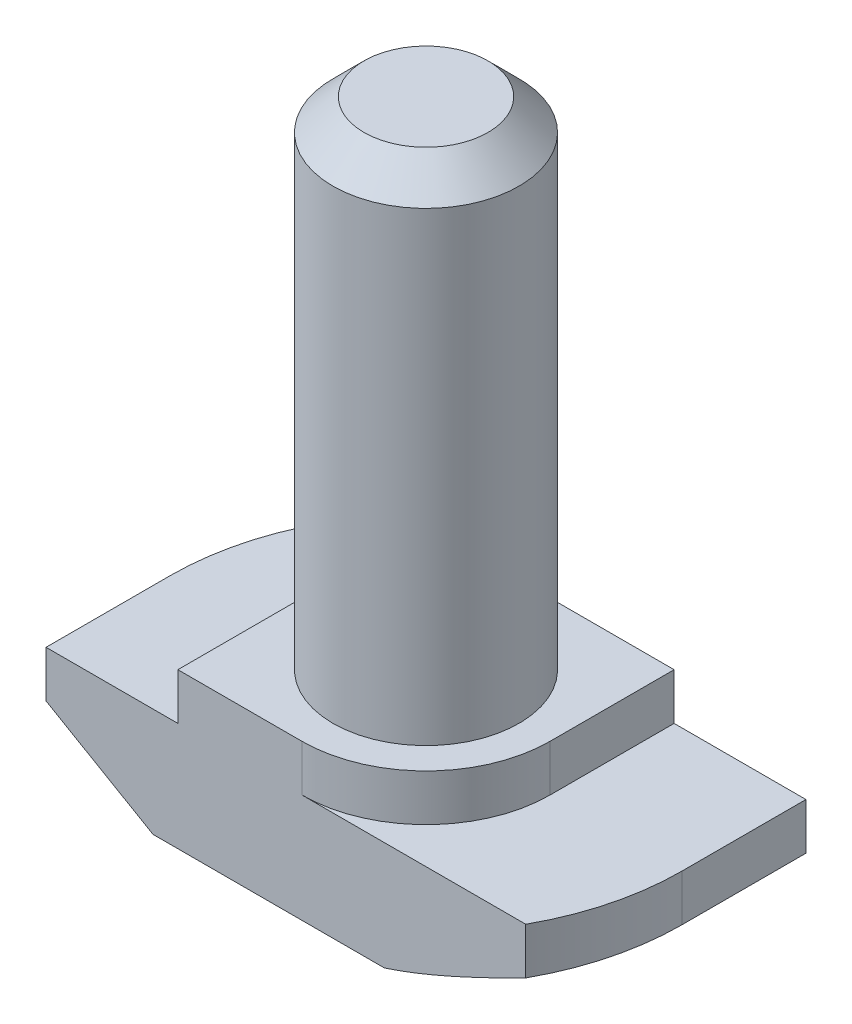
ISO-10303-21;
HEADER;
FILE_DESCRIPTION(('STEP AP214'),'2;1');
FILE_NAME('part.step','',(''),(''),'','','');
FILE_SCHEMA(('AUTOMOTIVE_DESIGN { 1 0 10303 214 1 1 1 1 }'));
ENDSEC;
DATA;
#1=APPLICATION_CONTEXT('core data for automotive mechanical design processes');
#2=APPLICATION_PROTOCOL_DEFINITION('international standard','automotive_design',2000,#1);
#3=PRODUCT_CONTEXT('',#1,'mechanical');
#4=PRODUCT('Part','Part','',(#3));
#5=PRODUCT_RELATED_PRODUCT_CATEGORY('part','',(#4));
#6=PRODUCT_DEFINITION_FORMATION('','',#4);
#7=PRODUCT_DEFINITION_CONTEXT('part definition',#1,'design');
#8=PRODUCT_DEFINITION('design','',#6,#7);
#9=PRODUCT_DEFINITION_SHAPE('','',#8);
#10=(LENGTH_UNIT() NAMED_UNIT(*) SI_UNIT(.MILLI.,.METRE.));
#11=(NAMED_UNIT(*) PLANE_ANGLE_UNIT() SI_UNIT($,.RADIAN.));
#12=(NAMED_UNIT(*) SI_UNIT($,.STERADIAN.) SOLID_ANGLE_UNIT());
#13=UNCERTAINTY_MEASURE_WITH_UNIT(LENGTH_MEASURE(1.E-05),#10,'distance_accuracy_value','');
#14=(GEOMETRIC_REPRESENTATION_CONTEXT(3) GLOBAL_UNCERTAINTY_ASSIGNED_CONTEXT((#13)) GLOBAL_UNIT_ASSIGNED_CONTEXT((#10,
#11,#12)) REPRESENTATION_CONTEXT('',''));
#15=CARTESIAN_POINT('',(0.,0.,0.));
#16=DIRECTION('',(0.,0.,1.));
#17=DIRECTION('',(1.,0.,0.));
#18=AXIS2_PLACEMENT_3D('',#15,#16,#17);
#19=CARTESIAN_POINT('',(-8.25,0.,4.));
#20=DIRECTION('',(1.,0.,0.));
#21=DIRECTION('',(0.,0.,-1.));
#22=AXIS2_PLACEMENT_3D('',#19,#20,#21);
#23=PLANE('',#22);
#24=DIRECTION('',(0.,0.,-1.));
#25=VECTOR('',#24,1.);
#26=CARTESIAN_POINT('',(-8.25,2.,4.));
#27=LINE('',#26,#25);
#28=CARTESIAN_POINT('',(-8.25,2.,4.));
#29=VERTEX_POINT('',#28);
#30=CARTESIAN_POINT('',(-8.25,2.,0.));
#31=VERTEX_POINT('',#30);
#32=EDGE_CURVE('E378',#29,#31,#27,.T.);
#33=ORIENTED_EDGE('',*,*,#32,.F.);
#34=DIRECTION('',(0.,-1.,0.));
#35=VECTOR('',#34,1.);
#36=CARTESIAN_POINT('',(-8.25,0.,4.));
#37=LINE('',#36,#35);
#38=CARTESIAN_POINT('',(-8.25,3.5,4.));
#39=VERTEX_POINT('',#38);
#40=EDGE_CURVE('E211',#39,#29,#37,.T.);
#41=ORIENTED_EDGE('',*,*,#40,.F.);
#42=DIRECTION('',(0.,0.,-1.));
#43=VECTOR('',#42,1.);
#44=CARTESIAN_POINT('',(-8.25,3.5,4.));
#45=LINE('',#44,#43);
#46=CARTESIAN_POINT('',(-8.25,3.5,0.));
#47=VERTEX_POINT('',#46);
#48=EDGE_CURVE('E226',#39,#47,#45,.T.);
#49=ORIENTED_EDGE('',*,*,#48,.T.);
#50=DIRECTION('',(0.,1.,0.));
#51=VECTOR('',#50,1.);
#52=CARTESIAN_POINT('',(-8.25,0.,0.));
#53=LINE('',#52,#51);
#54=EDGE_CURVE('E189',#31,#47,#53,.T.);
#55=ORIENTED_EDGE('',*,*,#54,.F.);
#56=EDGE_LOOP('',(#33,#41,#49,#55));
#57=FACE_BOUND('',#56,.T.);
#58=ADVANCED_FACE('F39',(#57),#23,.F.);
#59=CARTESIAN_POINT('',(8.25,0.,4.));
#60=DIRECTION('',(0.,1.,0.));
#61=DIRECTION('',(0.,0.,1.));
#62=AXIS2_PLACEMENT_3D('',#59,#60,#61);
#63=PLANE('',#62);
#64=DIRECTION('',(1.,0.,0.));
#65=VECTOR('',#64,1.);
#66=CARTESIAN_POINT('',(8.25,0.,4.));
#67=LINE('',#66,#65);
#68=CARTESIAN_POINT('',(-4.8,0.,4.));
#69=VERTEX_POINT('',#68);
#70=CARTESIAN_POINT('',(2.65329983228432,0.,4.));
#71=VERTEX_POINT('',#70);
#72=EDGE_CURVE('E214',#69,#71,#67,.T.);
#73=ORIENTED_EDGE('',*,*,#72,.F.);
#74=DIRECTION('',(0.,0.,-1.));
#75=VECTOR('',#74,1.);
#76=CARTESIAN_POINT('',(-4.8,0.,4.));
#77=LINE('',#76,#75);
#78=CARTESIAN_POINT('',(-4.8,0.,0.));
#79=VERTEX_POINT('',#78);
#80=EDGE_CURVE('E385',#69,#79,#77,.T.);
#81=ORIENTED_EDGE('',*,*,#80,.T.);
#82=CARTESIAN_POINT('',(0.,0.,0.));
#83=DIRECTION('',(0.,-1.,0.));
#84=DIRECTION('',(-1.,0.,0.));
#85=AXIS2_PLACEMENT_3D('',#82,#83,#84);
#86=CIRCLE('',#85,4.8);
#87=CARTESIAN_POINT('',(-2.65329983228432,0.,-4.));
#88=VERTEX_POINT('',#87);
#89=EDGE_CURVE('E380',#79,#88,#86,.T.);
#90=ORIENTED_EDGE('',*,*,#89,.T.);
#91=DIRECTION('',(1.,0.,0.));
#92=VECTOR('',#91,1.);
#93=CARTESIAN_POINT('',(8.25,0.,-4.));
#94=LINE('',#93,#92);
#95=CARTESIAN_POINT('',(4.80000000000001,0.,-4.));
#96=VERTEX_POINT('',#95);
#97=EDGE_CURVE('E207',#88,#96,#94,.T.);
#98=ORIENTED_EDGE('',*,*,#97,.T.);
#99=DIRECTION('',(0.,0.,1.));
#100=VECTOR('',#99,1.);
#101=CARTESIAN_POINT('',(4.8,0.,-8.25));
#102=LINE('',#101,#100);
#103=CARTESIAN_POINT('',(4.8,0.,0.));
#104=VERTEX_POINT('',#103);
#105=EDGE_CURVE('E55',#96,#104,#102,.T.);
#106=ORIENTED_EDGE('',*,*,#105,.T.);
#107=CARTESIAN_POINT('',(0.,0.,0.));
#108=DIRECTION('',(0.,-1.,0.));
#109=DIRECTION('',(1.,0.,0.));
#110=AXIS2_PLACEMENT_3D('',#107,#108,#109);
#111=CIRCLE('',#110,4.8);
#112=EDGE_CURVE('E155',#104,#71,#111,.T.);
#113=ORIENTED_EDGE('',*,*,#112,.T.);
#114=EDGE_LOOP('',(#73,#81,#90,#98,#106,#113));
#115=FACE_BOUND('',#114,.T.);
#116=ADVANCED_FACE('F272',(#115),#63,.F.);
#117=CARTESIAN_POINT('',(8.25,0.,4.));
#118=DIRECTION('',(-1.,0.,0.));
#119=DIRECTION('',(0.,0.,1.));
#120=AXIS2_PLACEMENT_3D('',#117,#118,#119);
#121=PLANE('',#120);
#122=DIRECTION('',(0.,0.,1.));
#123=VECTOR('',#122,1.);
#124=CARTESIAN_POINT('',(8.25,2.,-8.25));
#125=LINE('',#124,#123);
#126=CARTESIAN_POINT('',(8.25,2.,-4.));
#127=VERTEX_POINT('',#126);
#128=CARTESIAN_POINT('',(8.25,2.,0.));
#129=VERTEX_POINT('',#128);
#130=EDGE_CURVE('E147',#127,#129,#125,.T.);
#131=ORIENTED_EDGE('',*,*,#130,.F.);
#132=DIRECTION('',(0.,1.,0.));
#133=VECTOR('',#132,1.);
#134=CARTESIAN_POINT('',(8.25,0.,-4.));
#135=LINE('',#134,#133);
#136=CARTESIAN_POINT('',(8.25,3.5,-4.));
#137=VERTEX_POINT('',#136);
#138=EDGE_CURVE('E229',#127,#137,#135,.T.);
#139=ORIENTED_EDGE('',*,*,#138,.T.);
#140=DIRECTION('',(0.,0.,-1.));
#141=VECTOR('',#140,1.);
#142=CARTESIAN_POINT('',(8.25,3.5,4.));
#143=LINE('',#142,#141);
#144=CARTESIAN_POINT('',(8.25,3.5,0.));
#145=VERTEX_POINT('',#144);
#146=EDGE_CURVE('E175',#145,#137,#143,.T.);
#147=ORIENTED_EDGE('',*,*,#146,.F.);
#148=DIRECTION('',(0.,1.,0.));
#149=VECTOR('',#148,1.);
#150=CARTESIAN_POINT('',(8.25,0.,0.));
#151=LINE('',#150,#149);
#152=EDGE_CURVE('E168',#129,#145,#151,.T.);
#153=ORIENTED_EDGE('',*,*,#152,.F.);
#154=EDGE_LOOP('',(#131,#139,#147,#153));
#155=FACE_BOUND('',#154,.T.);
#156=ADVANCED_FACE('F173',(#155),#121,.F.);
#157=CARTESIAN_POINT('',(0.,0.,4.));
#158=DIRECTION('',(0.,0.,-1.));
#159=DIRECTION('',(-1.,0.,0.));
#160=AXIS2_PLACEMENT_3D('',#157,#158,#159);
#161=PLANE('',#160);
#162=DIRECTION('',(-0.865140001465014,0.501530435631892,0.));
#163=VECTOR('',#162,1.);
#164=CARTESIAN_POINT('',(-8.25,2.,4.));
#165=LINE('',#164,#163);
#166=EDGE_CURVE('E375',#69,#29,#165,.T.);
#167=ORIENTED_EDGE('',*,*,#166,.F.);
#168=ORIENTED_EDGE('',*,*,#72,.T.);
#169=CARTESIAN_POINT('',(7.21613484483091,2.0003549134462,4.));
#170=CARTESIAN_POINT('',(7.00803970436404,1.89487548087015,4.));
#171=CARTESIAN_POINT('',(6.79952972935955,1.79020095274389,4.));
#172=CARTESIAN_POINT('',(6.38141619995093,1.58297775175222,4.));
#173=CARTESIAN_POINT('',(6.17181247821434,1.48042941686438,4.));
#174=CARTESIAN_POINT('',(5.75012610139641,1.27743688550797,4.));
#175=CARTESIAN_POINT('',(5.53803613192248,1.17700783619689,4.));
#176=CARTESIAN_POINT('',(5.11224507719435,0.979646422001181,4.));
#177=CARTESIAN_POINT('',(4.89854408973364,0.882713846904101,4.));
#178=CARTESIAN_POINT('',(4.47468804361086,0.695863667964241,4.));
#179=CARTESIAN_POINT('',(4.26458467058549,0.605829354091029,4.));
#180=CARTESIAN_POINT('',(3.84197805474476,0.431451218393863,4.));
#181=CARTESIAN_POINT('',(3.62947448107497,0.347108192539339,4.));
#182=CARTESIAN_POINT('',(3.20203119027067,0.186199507823433,4.));
#183=CARTESIAN_POINT('',(2.98709757123852,0.109617788058737,4.));
#184=CARTESIAN_POINT('',(2.55389923857815,-0.0333694214142198,4.));
#185=CARTESIAN_POINT('',(2.335635805222,-0.0997787190081176,4.));
#186=CARTESIAN_POINT('',(1.94387785307005,-0.205950476079878,4.));
#187=CARTESIAN_POINT('',(1.77110601239678,-0.248360632646801,4.));
#188=CARTESIAN_POINT('',(1.42340457971586,-0.323102278453015,4.));
#189=CARTESIAN_POINT('',(1.24847577109918,-0.355437320952206,4.));
#190=CARTESIAN_POINT('',(0.983956924298375,-0.395158813845938,4.));
#191=CARTESIAN_POINT('',(0.895019468024547,-0.406969239956406,4.));
#192=CARTESIAN_POINT('',(0.716775216335157,-0.427377110640959,4.));
#193=CARTESIAN_POINT('',(0.627468434142931,-0.435974669258559,4.));
#194=CARTESIAN_POINT('',(0.448426860519632,-0.449809265298282,4.));
#195=CARTESIAN_POINT('',(0.358691582104533,-0.455040027620334,4.));
#196=CARTESIAN_POINT('',(0.179071951147261,-0.462030129716251,4.));
#197=CARTESIAN_POINT('',(0.0891875769025257,-0.463788909656104,4.));
#198=CARTESIAN_POINT('',(-0.00069999999999965,-0.463768080434785,4.));
#199=B_SPLINE_CURVE_WITH_KNOTS('',3,(#169,#170,#171,#172,#173,#174,#175,#176,#177,#178,#179,
#180,#181,#182,#183,#184,#185,#186,#187,#188,#189,#190,#191,#192,#193,#194,#195,#196,#197,#198),
.UNSPECIFIED.,.F.,.F.,(4,2,2,2,2,2,2,2,2,2,2,2,2,2,4),(0.,0.699911319164634,1.39993305552495,
2.10390673397942,2.80783801786106,3.49352135898838,4.1793004001725,4.86363002992971,
5.54770286235738,6.08117447291671,6.61445772685287,6.88356350314874,7.15265972639443,
7.42225605507736,7.6918958508215),.UNSPECIFIED.);
#200=CARTESIAN_POINT('',(7.21543484483091,2.,4.));
#201=VERTEX_POINT('',#200);
#202=EDGE_CURVE('E320',#201,#71,#199,.T.);
#203=ORIENTED_EDGE('',*,*,#202,.F.);
#204=DIRECTION('',(0.,1.,0.));
#205=VECTOR('',#204,1.);
#206=CARTESIAN_POINT('',(7.21543484483091,0.,4.));
#207=LINE('',#206,#205);
#208=CARTESIAN_POINT('',(7.21543484483091,3.5,4.));
#209=VERTEX_POINT('',#208);
#210=EDGE_CURVE('E170',#201,#209,#207,.T.);
#211=ORIENTED_EDGE('',*,*,#210,.T.);
#212=DIRECTION('',(-1.,0.,0.));
#213=VECTOR('',#212,1.);
#214=CARTESIAN_POINT('',(8.25,3.5,4.));
#215=LINE('',#214,#213);
#216=CARTESIAN_POINT('',(0.,3.5,4.));
#217=VERTEX_POINT('',#216);
#218=EDGE_CURVE('E218',#209,#217,#215,.T.);
#219=ORIENTED_EDGE('',*,*,#218,.T.);
#220=DIRECTION('',(0.,1.,0.));
#221=VECTOR('',#220,1.);
#222=CARTESIAN_POINT('',(0.,-2.15685424949238,4.));
#223=LINE('',#222,#221);
#224=CARTESIAN_POINT('',(0.,5.,4.));
#225=VERTEX_POINT('',#224);
#226=EDGE_CURVE('E193',#217,#225,#223,.T.);
#227=ORIENTED_EDGE('',*,*,#226,.T.);
#228=DIRECTION('',(-1.,0.,0.));
#229=VECTOR('',#228,1.);
#230=CARTESIAN_POINT('',(-4.,5.,4.));
#231=LINE('',#230,#229);
#232=CARTESIAN_POINT('',(-4.,5.,4.));
#233=VERTEX_POINT('',#232);
#234=EDGE_CURVE('E220',#225,#233,#231,.T.);
#235=ORIENTED_EDGE('',*,*,#234,.T.);
#236=DIRECTION('',(0.,-1.,0.));
#237=VECTOR('',#236,1.);
#238=CARTESIAN_POINT('',(-4.,3.5,4.));
#239=LINE('',#238,#237);
#240=CARTESIAN_POINT('',(-4.,3.5,4.));
#241=VERTEX_POINT('',#240);
#242=EDGE_CURVE('E222',#233,#241,#239,.T.);
#243=ORIENTED_EDGE('',*,*,#242,.T.);
#244=DIRECTION('',(-1.,0.,0.));
#245=VECTOR('',#244,1.);
#246=CARTESIAN_POINT('',(-8.25,3.5,4.));
#247=LINE('',#246,#245);
#248=EDGE_CURVE('E224',#241,#39,#247,.T.);
#249=ORIENTED_EDGE('',*,*,#248,.T.);
#250=ORIENTED_EDGE('',*,*,#40,.T.);
#251=EDGE_LOOP('',(#167,#168,#203,#211,#219,#227,#235,#243,#249,#250));
#252=FACE_BOUND('',#251,.T.);
#253=ADVANCED_FACE('F283',(#252),#161,.F.);
#254=CARTESIAN_POINT('',(0.,0.,-4.));
#255=DIRECTION('',(0.,0.,-1.));
#256=DIRECTION('',(-1.,0.,0.));
#257=AXIS2_PLACEMENT_3D('',#254,#255,#256);
#258=PLANE('',#257);
#259=ORIENTED_EDGE('',*,*,#97,.F.);
#260=CARTESIAN_POINT('',(0.000700000000000375,-0.463768080434785,-4.));
#261=CARTESIAN_POINT('',(-0.114358329126842,-0.463810330474809,-4.));
#262=CARTESIAN_POINT('',(-0.229406181940068,-0.460914168315143,-4.));
#263=CARTESIAN_POINT('',(-0.459176742974354,-0.449474548764103,-4.));
#264=CARTESIAN_POINT('',(-0.57389956214311,-0.440933333753936,-4.));
#265=CARTESIAN_POINT('',(-0.802392674882517,-0.418473597439302,-4.));
#266=CARTESIAN_POINT('',(-0.916164913889914,-0.404574683855251,-4.));
#267=CARTESIAN_POINT('',(-1.14299095826047,-0.371797484060063,-4.));
#268=CARTESIAN_POINT('',(-1.25604469638226,-0.352918738635892,-4.));
#269=CARTESIAN_POINT('',(-1.59163927955896,-0.289934054709893,-4.));
#270=CARTESIAN_POINT('',(-1.81295324620339,-0.2392310938484,-4.));
#271=CARTESIAN_POINT('',(-2.25206021197157,-0.123936902790817,-4.));
#272=CARTESIAN_POINT('',(-2.46984941141581,-0.0593316355484477,-4.));
#273=CARTESIAN_POINT('',(-2.88037850276595,0.0733420675422271,-4.));
#274=CARTESIAN_POINT('',(-3.07344388746432,0.140416766220987,-4.));
#275=CARTESIAN_POINT('',(-3.45719283003243,0.281096697707297,-4.));
#276=CARTESIAN_POINT('',(-3.64787603311774,0.354702890346021,-4.));
#277=CARTESIAN_POINT('',(-4.02730947884495,0.506983699161029,-4.));
#278=CARTESIAN_POINT('',(-4.21605866884565,0.585660921505602,-4.));
#279=CARTESIAN_POINT('',(-4.59187708411018,0.746935123081622,-4.));
#280=CARTESIAN_POINT('',(-4.7789462360487,0.82953227241918,-4.));
#281=CARTESIAN_POINT('',(-5.1553974190999,0.999479450573734,-4.));
#282=CARTESIAN_POINT('',(-5.34475143087342,1.08689134221783,-4.));
#283=CARTESIAN_POINT('',(-5.72226955769912,1.2642563082982,-4.));
#284=CARTESIAN_POINT('',(-5.91043363638288,1.3542094599491,-4.));
#285=CARTESIAN_POINT('',(-6.28532802201771,1.53593133899591,-4.));
#286=CARTESIAN_POINT('',(-6.4720606749939,1.62769523793753,-4.));
#287=CARTESIAN_POINT('',(-6.84468479484796,1.81287486096299,-4.));
#288=CARTESIAN_POINT('',(-7.03057633605051,1.90629043536975,-4.));
#289=CARTESIAN_POINT('',(-7.21613484483091,2.0003549134462,-4.));
#290=B_SPLINE_CURVE_WITH_KNOTS('',3,(#260,#261,#262,#263,#264,#265,#266,#267,#268,#269,#270,
#271,#272,#273,#274,#275,#276,#277,#278,#279,#280,#281,#282,#283,#284,#285,#286,#287,#288,#289),
.UNSPECIFIED.,.F.,.F.,(4,2,2,2,2,2,2,2,2,2,2,2,2,2,4),(0.,0.345120812912262,0.690104616005523,
1.03383767850813,1.37760244929378,2.05809541547289,2.73927872108519,3.35228685457644,
3.9653852219153,4.57880123256928,5.19224388693237,5.81788979165579,6.44355472673186,
7.06773117786113,7.69185135226981),.UNSPECIFIED.);
#291=CARTESIAN_POINT('',(-7.21543484483091,2.,-4.));
#292=VERTEX_POINT('',#291);
#293=EDGE_CURVE('E314',#88,#292,#290,.T.);
#294=ORIENTED_EDGE('',*,*,#293,.T.);
#295=DIRECTION('',(0.,1.,0.));
#296=VECTOR('',#295,1.);
#297=CARTESIAN_POINT('',(-7.21543484483091,0.,-4.));
#298=LINE('',#297,#296);
#299=CARTESIAN_POINT('',(-7.21543484483091,3.5,-4.));
#300=VERTEX_POINT('',#299);
#301=EDGE_CURVE('E179',#292,#300,#298,.T.);
#302=ORIENTED_EDGE('',*,*,#301,.T.);
#303=DIRECTION('',(-1.,0.,0.));
#304=VECTOR('',#303,1.);
#305=CARTESIAN_POINT('',(-8.25,3.5,-4.));
#306=LINE('',#305,#304);
#307=CARTESIAN_POINT('',(0.,3.5,-4.));
#308=VERTEX_POINT('',#307);
#309=EDGE_CURVE('E215',#308,#300,#306,.T.);
#310=ORIENTED_EDGE('',*,*,#309,.F.);
#311=DIRECTION('',(0.,1.,0.));
#312=VECTOR('',#311,1.);
#313=CARTESIAN_POINT('',(0.,-2.15685424949238,-4.));
#314=LINE('',#313,#312);
#315=CARTESIAN_POINT('',(0.,5.,-4.));
#316=VERTEX_POINT('',#315);
#317=EDGE_CURVE('E203',#308,#316,#314,.T.);
#318=ORIENTED_EDGE('',*,*,#317,.T.);
#319=DIRECTION('',(-1.,0.,0.));
#320=VECTOR('',#319,1.);
#321=CARTESIAN_POINT('',(-4.,5.,-4.));
#322=LINE('',#321,#320);
#323=CARTESIAN_POINT('',(4.,5.,-4.));
#324=VERTEX_POINT('',#323);
#325=EDGE_CURVE('E237',#324,#316,#322,.T.);
#326=ORIENTED_EDGE('',*,*,#325,.F.);
#327=DIRECTION('',(0.,1.,0.));
#328=VECTOR('',#327,1.);
#329=CARTESIAN_POINT('',(4.,3.5,-4.));
#330=LINE('',#329,#328);
#331=CARTESIAN_POINT('',(4.,3.5,-4.));
#332=VERTEX_POINT('',#331);
#333=EDGE_CURVE('E234',#332,#324,#330,.T.);
#334=ORIENTED_EDGE('',*,*,#333,.F.);
#335=DIRECTION('',(-1.,0.,0.));
#336=VECTOR('',#335,1.);
#337=CARTESIAN_POINT('',(8.25,3.5,-4.));
#338=LINE('',#337,#336);
#339=EDGE_CURVE('E231',#137,#332,#338,.T.);
#340=ORIENTED_EDGE('',*,*,#339,.F.);
#341=ORIENTED_EDGE('',*,*,#138,.F.);
#342=DIRECTION('',(-0.865140001465014,-0.501530435631892,0.));
#343=VECTOR('',#342,1.);
#344=CARTESIAN_POINT('',(1.20735733375256,-2.08269140072316,-4.));
#345=LINE('',#344,#343);
#346=EDGE_CURVE('E151',#127,#96,#345,.T.);
#347=ORIENTED_EDGE('',*,*,#346,.T.);
#348=EDGE_LOOP('',(#259,#294,#302,#310,#318,#326,#334,#340,#341,#347));
#349=FACE_BOUND('',#348,.T.);
#350=ADVANCED_FACE('F305',(#349),#258,.T.);
#351=CARTESIAN_POINT('',(0.,0.,0.));
#352=DIRECTION('',(0.,1.,0.));
#353=DIRECTION('',(0.,0.,1.));
#354=AXIS2_PLACEMENT_3D('',#351,#352,#353);
#355=CYLINDRICAL_SURFACE('',#354,8.25);
#356=CARTESIAN_POINT('',(0.,2.,0.));
#357=DIRECTION('',(0.,-1.,0.));
#358=DIRECTION('',(-1.,0.,0.));
#359=AXIS2_PLACEMENT_3D('',#356,#357,#358);
#360=CIRCLE('',#359,8.25);
#361=EDGE_CURVE('E63',#31,#292,#360,.T.);
#362=ORIENTED_EDGE('',*,*,#361,.F.);
#363=ORIENTED_EDGE('',*,*,#54,.T.);
#364=CARTESIAN_POINT('',(0.,3.5,0.));
#365=DIRECTION('',(0.,-1.,0.));
#366=DIRECTION('',(0.,0.,-1.));
#367=AXIS2_PLACEMENT_3D('',#364,#365,#366);
#368=CIRCLE('',#367,8.25);
#369=EDGE_CURVE('E176',#47,#300,#368,.T.);
#370=ORIENTED_EDGE('',*,*,#369,.T.);
#371=ORIENTED_EDGE('',*,*,#301,.F.);
#372=EDGE_LOOP('',(#362,#363,#370,#371));
#373=FACE_BOUND('',#372,.T.);
#374=ADVANCED_FACE('F309',(#373),#355,.T.);
#375=CARTESIAN_POINT('',(0.,0.,0.));
#376=DIRECTION('',(0.,1.,0.));
#377=DIRECTION('',(0.,0.,1.));
#378=AXIS2_PLACEMENT_3D('',#375,#376,#377);
#379=CYLINDRICAL_SURFACE('',#378,8.25);
#380=CARTESIAN_POINT('',(0.,2.,0.));
#381=DIRECTION('',(0.,-1.,0.));
#382=DIRECTION('',(1.,0.,0.));
#383=AXIS2_PLACEMENT_3D('',#380,#381,#382);
#384=CIRCLE('',#383,8.25);
#385=EDGE_CURVE('E160',#129,#201,#384,.T.);
#386=ORIENTED_EDGE('',*,*,#385,.F.);
#387=ORIENTED_EDGE('',*,*,#152,.T.);
#388=CARTESIAN_POINT('',(0.,3.5,0.));
#389=DIRECTION('',(0.,-1.,0.));
#390=DIRECTION('',(0.,0.,-1.));
#391=AXIS2_PLACEMENT_3D('',#388,#389,#390);
#392=CIRCLE('',#391,8.25);
#393=EDGE_CURVE('E181',#145,#209,#392,.T.);
#394=ORIENTED_EDGE('',*,*,#393,.T.);
#395=ORIENTED_EDGE('',*,*,#210,.F.);
#396=EDGE_LOOP('',(#386,#387,#394,#395));
#397=FACE_BOUND('',#396,.T.);
#398=ADVANCED_FACE('F166',(#397),#379,.T.);
#399=CARTESIAN_POINT('',(-4.,5.,4.));
#400=DIRECTION('',(0.,-1.,0.));
#401=DIRECTION('',(0.,0.,-1.));
#402=AXIS2_PLACEMENT_3D('',#399,#400,#401);
#403=PLANE('',#402);
#404=CARTESIAN_POINT('',(0.,5.,0.));
#405=DIRECTION('',(0.,1.,0.));
#406=DIRECTION('',(0.,0.,1.));
#407=AXIS2_PLACEMENT_3D('',#404,#405,#406);
#408=CIRCLE('',#407,3.);
#409=CARTESIAN_POINT('',(0.,5.,3.));
#410=VERTEX_POINT('',#409);
#411=EDGE_CURVE('E208',#410,#410,#408,.T.);
#412=ORIENTED_EDGE('',*,*,#411,.F.);
#413=EDGE_LOOP('',(#412));
#414=FACE_BOUND('',#413,.T.);
#415=ORIENTED_EDGE('',*,*,#234,.F.);
#416=CARTESIAN_POINT('',(0.,5.,0.));
#417=DIRECTION('',(0.,-1.,0.));
#418=DIRECTION('',(0.,0.,-1.));
#419=AXIS2_PLACEMENT_3D('',#416,#417,#418);
#420=CIRCLE('',#419,4.);
#421=CARTESIAN_POINT('',(4.,5.,0.));
#422=VERTEX_POINT('',#421);
#423=EDGE_CURVE('E186',#422,#225,#420,.T.);
#424=ORIENTED_EDGE('',*,*,#423,.F.);
#425=DIRECTION('',(0.,0.,-1.));
#426=VECTOR('',#425,1.);
#427=CARTESIAN_POINT('',(4.,5.,4.));
#428=LINE('',#427,#426);
#429=EDGE_CURVE('E250',#422,#324,#428,.T.);
#430=ORIENTED_EDGE('',*,*,#429,.T.);
#431=ORIENTED_EDGE('',*,*,#325,.T.);
#432=CARTESIAN_POINT('',(0.,5.,0.));
#433=DIRECTION('',(0.,-1.,0.));
#434=DIRECTION('',(0.,0.,-1.));
#435=AXIS2_PLACEMENT_3D('',#432,#433,#434);
#436=CIRCLE('',#435,4.);
#437=CARTESIAN_POINT('',(-4.,5.,0.));
#438=VERTEX_POINT('',#437);
#439=EDGE_CURVE('E197',#438,#316,#436,.T.);
#440=ORIENTED_EDGE('',*,*,#439,.F.);
#441=DIRECTION('',(0.,0.,-1.));
#442=VECTOR('',#441,1.);
#443=CARTESIAN_POINT('',(-4.,5.,4.));
#444=LINE('',#443,#442);
#445=EDGE_CURVE('E247',#233,#438,#444,.T.);
#446=ORIENTED_EDGE('',*,*,#445,.F.);
#447=EDGE_LOOP('',(#415,#424,#430,#431,#440,#446));
#448=FACE_BOUND('',#447,.T.);
#449=ADVANCED_FACE('F288',(#414,#448),#403,.F.);
#450=CARTESIAN_POINT('',(8.25,3.5,4.));
#451=DIRECTION('',(0.,-1.,0.));
#452=DIRECTION('',(0.,0.,-1.));
#453=AXIS2_PLACEMENT_3D('',#450,#451,#452);
#454=PLANE('',#453);
#455=ORIENTED_EDGE('',*,*,#218,.F.);
#456=ORIENTED_EDGE('',*,*,#393,.F.);
#457=ORIENTED_EDGE('',*,*,#146,.T.);
#458=ORIENTED_EDGE('',*,*,#339,.T.);
#459=DIRECTION('',(0.,0.,-1.));
#460=VECTOR('',#459,1.);
#461=CARTESIAN_POINT('',(4.,3.5,4.));
#462=LINE('',#461,#460);
#463=CARTESIAN_POINT('',(4.,3.5,0.));
#464=VERTEX_POINT('',#463);
#465=EDGE_CURVE('E252',#464,#332,#462,.T.);
#466=ORIENTED_EDGE('',*,*,#465,.F.);
#467=CARTESIAN_POINT('',(0.,3.5,0.));
#468=DIRECTION('',(0.,-1.,0.));
#469=DIRECTION('',(0.,0.,-1.));
#470=AXIS2_PLACEMENT_3D('',#467,#468,#469);
#471=CIRCLE('',#470,4.);
#472=EDGE_CURVE('E190',#464,#217,#471,.T.);
#473=ORIENTED_EDGE('',*,*,#472,.T.);
#474=EDGE_LOOP('',(#455,#456,#457,#458,#466,#473));
#475=FACE_BOUND('',#474,.T.);
#476=ADVANCED_FACE('F284',(#475),#454,.F.);
#477=CARTESIAN_POINT('',(4.,3.5,4.));
#478=DIRECTION('',(-1.,0.,0.));
#479=DIRECTION('',(0.,0.,1.));
#480=AXIS2_PLACEMENT_3D('',#477,#478,#479);
#481=PLANE('',#480);
#482=ORIENTED_EDGE('',*,*,#429,.F.);
#483=DIRECTION('',(0.,1.,0.));
#484=VECTOR('',#483,1.);
#485=CARTESIAN_POINT('',(4.,-2.15685424949238,0.));
#486=LINE('',#485,#484);
#487=EDGE_CURVE('E188',#464,#422,#486,.T.);
#488=ORIENTED_EDGE('',*,*,#487,.F.);
#489=ORIENTED_EDGE('',*,*,#465,.T.);
#490=ORIENTED_EDGE('',*,*,#333,.T.);
#491=EDGE_LOOP('',(#482,#488,#489,#490));
#492=FACE_BOUND('',#491,.T.);
#493=ADVANCED_FACE('F287',(#492),#481,.F.);
#494=CARTESIAN_POINT('',(-4.,3.5,4.));
#495=DIRECTION('',(1.,0.,0.));
#496=DIRECTION('',(0.,0.,-1.));
#497=AXIS2_PLACEMENT_3D('',#494,#495,#496);
#498=PLANE('',#497);
#499=ORIENTED_EDGE('',*,*,#445,.T.);
#500=DIRECTION('',(0.,1.,0.));
#501=VECTOR('',#500,1.);
#502=CARTESIAN_POINT('',(-4.,-2.15685424949238,0.));
#503=LINE('',#502,#501);
#504=CARTESIAN_POINT('',(-4.,3.5,0.));
#505=VERTEX_POINT('',#504);
#506=EDGE_CURVE('E199',#505,#438,#503,.T.);
#507=ORIENTED_EDGE('',*,*,#506,.F.);
#508=DIRECTION('',(0.,0.,-1.));
#509=VECTOR('',#508,1.);
#510=CARTESIAN_POINT('',(-4.,3.5,4.));
#511=LINE('',#510,#509);
#512=EDGE_CURVE('E244',#241,#505,#511,.T.);
#513=ORIENTED_EDGE('',*,*,#512,.F.);
#514=ORIENTED_EDGE('',*,*,#242,.F.);
#515=EDGE_LOOP('',(#499,#507,#513,#514));
#516=FACE_BOUND('',#515,.T.);
#517=ADVANCED_FACE('F292',(#516),#498,.F.);
#518=CARTESIAN_POINT('',(-8.25,3.5,4.));
#519=DIRECTION('',(0.,-1.,0.));
#520=DIRECTION('',(0.,0.,-1.));
#521=AXIS2_PLACEMENT_3D('',#518,#519,#520);
#522=PLANE('',#521);
#523=ORIENTED_EDGE('',*,*,#309,.T.);
#524=ORIENTED_EDGE('',*,*,#369,.F.);
#525=ORIENTED_EDGE('',*,*,#48,.F.);
#526=ORIENTED_EDGE('',*,*,#248,.F.);
#527=ORIENTED_EDGE('',*,*,#512,.T.);
#528=CARTESIAN_POINT('',(0.,3.5,0.));
#529=DIRECTION('',(0.,-1.,0.));
#530=DIRECTION('',(0.,0.,-1.));
#531=AXIS2_PLACEMENT_3D('',#528,#529,#530);
#532=CIRCLE('',#531,4.);
#533=EDGE_CURVE('E200',#505,#308,#532,.T.);
#534=ORIENTED_EDGE('',*,*,#533,.T.);
#535=EDGE_LOOP('',(#523,#524,#525,#526,#527,#534));
#536=FACE_BOUND('',#535,.T.);
#537=ADVANCED_FACE('F299',(#536),#522,.F.);
#538=CARTESIAN_POINT('',(0.,21.,0.));
#539=DIRECTION('',(0.,-1.,0.));
#540=DIRECTION('',(0.,0.,-1.));
#541=AXIS2_PLACEMENT_3D('',#538,#539,#540);
#542=CYLINDRICAL_SURFACE('',#541,3.);
#543=CARTESIAN_POINT('',(0.,20.,0.));
#544=DIRECTION('',(0.,1.,0.));
#545=DIRECTION('',(0.,0.,1.));
#546=AXIS2_PLACEMENT_3D('',#543,#544,#545);
#547=CIRCLE('',#546,3.);
#548=CARTESIAN_POINT('',(0.,20.,3.));
#549=VERTEX_POINT('',#548);
#550=EDGE_CURVE('E11',#549,#549,#547,.F.);
#551=ORIENTED_EDGE('',*,*,#550,.T.);
#552=EDGE_LOOP('',(#551));
#553=FACE_BOUND('',#552,.T.);
#554=ORIENTED_EDGE('',*,*,#411,.T.);
#555=EDGE_LOOP('',(#554));
#556=FACE_BOUND('',#555,.T.);
#557=ADVANCED_FACE('F303',(#553,#556),#542,.T.);
#558=CARTESIAN_POINT('',(0.,21.,0.));
#559=DIRECTION('',(0.,1.,0.));
#560=DIRECTION('',(0.,0.,1.));
#561=AXIS2_PLACEMENT_3D('',#558,#559,#560);
#562=PLANE('',#561);
#563=CARTESIAN_POINT('',(0.,21.,0.));
#564=DIRECTION('',(0.,1.,0.));
#565=DIRECTION('',(0.,0.,1.));
#566=AXIS2_PLACEMENT_3D('',#563,#564,#565);
#567=CIRCLE('',#566,2.);
#568=CARTESIAN_POINT('',(0.,21.,2.));
#569=VERTEX_POINT('',#568);
#570=EDGE_CURVE('E48',#569,#569,#567,.T.);
#571=ORIENTED_EDGE('',*,*,#570,.T.);
#572=EDGE_LOOP('',(#571));
#573=FACE_BOUND('',#572,.T.);
#574=ADVANCED_FACE('F257',(#573),#562,.T.);
#575=CARTESIAN_POINT('',(0.,-2.15685424949238,0.));
#576=DIRECTION('',(0.,1.,0.));
#577=DIRECTION('',(0.,0.,1.));
#578=AXIS2_PLACEMENT_3D('',#575,#576,#577);
#579=CYLINDRICAL_SURFACE('',#578,4.);
#580=ORIENTED_EDGE('',*,*,#506,.T.);
#581=ORIENTED_EDGE('',*,*,#439,.T.);
#582=ORIENTED_EDGE('',*,*,#317,.F.);
#583=ORIENTED_EDGE('',*,*,#533,.F.);
#584=EDGE_LOOP('',(#580,#581,#582,#583));
#585=FACE_BOUND('',#584,.T.);
#586=ADVANCED_FACE('F339',(#585),#579,.T.);
#587=CARTESIAN_POINT('',(0.,-2.15685424949238,0.));
#588=DIRECTION('',(0.,1.,0.));
#589=DIRECTION('',(0.,0.,1.));
#590=AXIS2_PLACEMENT_3D('',#587,#588,#589);
#591=CYLINDRICAL_SURFACE('',#590,4.);
#592=ORIENTED_EDGE('',*,*,#487,.T.);
#593=ORIENTED_EDGE('',*,*,#423,.T.);
#594=ORIENTED_EDGE('',*,*,#226,.F.);
#595=ORIENTED_EDGE('',*,*,#472,.F.);
#596=EDGE_LOOP('',(#592,#593,#594,#595));
#597=FACE_BOUND('',#596,.T.);
#598=ADVANCED_FACE('F336',(#597),#591,.T.);
#599=CARTESIAN_POINT('',(8.25,2.,-8.25));
#600=DIRECTION('',(0.501530435631892,-0.865140001465014,0.));
#601=DIRECTION('',(0.865140001465014,0.501530435631892,0.));
#602=AXIS2_PLACEMENT_3D('',#599,#600,#601);
#603=PLANE('',#602);
#604=ORIENTED_EDGE('',*,*,#130,.T.);
#605=DIRECTION('',(0.865140001465014,0.501530435631892,0.));
#606=VECTOR('',#605,1.);
#607=CARTESIAN_POINT('',(8.25,2.,0.));
#608=LINE('',#607,#606);
#609=EDGE_CURVE('E150',#104,#129,#608,.T.);
#610=ORIENTED_EDGE('',*,*,#609,.F.);
#611=ORIENTED_EDGE('',*,*,#105,.F.);
#612=ORIENTED_EDGE('',*,*,#346,.F.);
#613=EDGE_LOOP('',(#604,#610,#611,#612));
#614=FACE_BOUND('',#613,.T.);
#615=ADVANCED_FACE('F149',(#614),#603,.T.);
#616=CARTESIAN_POINT('',(0.,0.,0.));
#617=DIRECTION('',(0.,1.,0.));
#618=DIRECTION('',(0.,0.,1.));
#619=AXIS2_PLACEMENT_3D('',#616,#617,#618);
#620=CONICAL_SURFACE('',#619,4.8,1.04542945297958);
#621=ORIENTED_EDGE('',*,*,#202,.T.);
#622=ORIENTED_EDGE('',*,*,#112,.F.);
#623=ORIENTED_EDGE('',*,*,#609,.T.);
#624=ORIENTED_EDGE('',*,*,#385,.T.);
#625=EDGE_LOOP('',(#621,#622,#623,#624));
#626=FACE_BOUND('',#625,.T.);
#627=ADVANCED_FACE('F159',(#626),#620,.T.);
#628=CARTESIAN_POINT('',(-8.25,2.,4.));
#629=DIRECTION('',(-0.501530435631892,-0.865140001465014,0.));
#630=DIRECTION('',(0.865140001465014,-0.501530435631892,0.));
#631=AXIS2_PLACEMENT_3D('',#628,#629,#630);
#632=PLANE('',#631);
#633=ORIENTED_EDGE('',*,*,#32,.T.);
#634=DIRECTION('',(-0.865140001465014,0.501530435631892,0.));
#635=VECTOR('',#634,1.);
#636=CARTESIAN_POINT('',(-8.25,2.,0.));
#637=LINE('',#636,#635);
#638=EDGE_CURVE('E381',#79,#31,#637,.T.);
#639=ORIENTED_EDGE('',*,*,#638,.F.);
#640=ORIENTED_EDGE('',*,*,#80,.F.);
#641=ORIENTED_EDGE('',*,*,#166,.T.);
#642=EDGE_LOOP('',(#633,#639,#640,#641));
#643=FACE_BOUND('',#642,.T.);
#644=ADVANCED_FACE('F262',(#643),#632,.T.);
#645=CARTESIAN_POINT('',(0.,0.,0.));
#646=DIRECTION('',(0.,1.,0.));
#647=DIRECTION('',(0.,0.,1.));
#648=AXIS2_PLACEMENT_3D('',#645,#646,#647);
#649=CONICAL_SURFACE('',#648,4.8,1.04542945297958);
#650=ORIENTED_EDGE('',*,*,#89,.F.);
#651=ORIENTED_EDGE('',*,*,#638,.T.);
#652=ORIENTED_EDGE('',*,*,#361,.T.);
#653=ORIENTED_EDGE('',*,*,#293,.F.);
#654=EDGE_LOOP('',(#650,#651,#652,#653));
#655=FACE_BOUND('',#654,.T.);
#656=ADVANCED_FACE('F260',(#655),#649,.T.);
#657=CARTESIAN_POINT('',(0.,21.,0.));
#658=DIRECTION('',(0.,-1.,0.));
#659=DIRECTION('',(0.,0.,-1.));
#660=AXIS2_PLACEMENT_3D('',#657,#658,#659);
#661=CONICAL_SURFACE('',#660,2.,0.785398163397446);
#662=ORIENTED_EDGE('',*,*,#550,.F.);
#663=EDGE_LOOP('',(#662));
#664=FACE_BOUND('',#663,.T.);
#665=ORIENTED_EDGE('',*,*,#570,.F.);
#666=EDGE_LOOP('',(#665));
#667=FACE_BOUND('',#666,.T.);
#668=ADVANCED_FACE('F42',(#664,#667),#661,.T.);
#669=CLOSED_SHELL('',(#58,#116,#156,#253,#350,#374,#398,#449,#476,#493,#517,#537,#557,#574,#586,
#598,#615,#627,#644,#656,#668));
#670=MANIFOLD_SOLID_BREP('B2',#669);
#671=ADVANCED_BREP_SHAPE_REPRESENTATION('',(#18,#670),#14);
#672=SHAPE_DEFINITION_REPRESENTATION(#9,#671);
ENDSEC;
END-ISO-10303-21;
